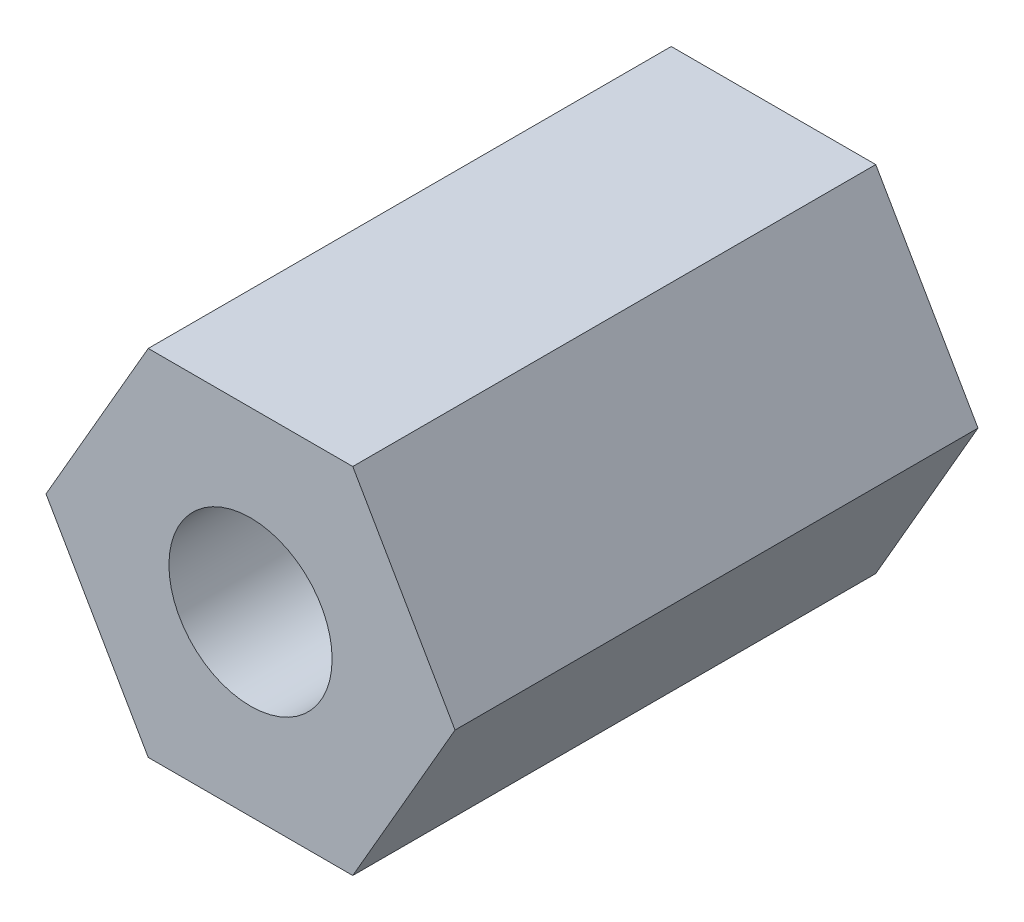
ISO-10303-21;
HEADER;
FILE_DESCRIPTION(('STEP AP214'),'2;1');
FILE_NAME('part.step','',(''),(''),'','','');
FILE_SCHEMA(('AUTOMOTIVE_DESIGN { 1 0 10303 214 1 1 1 1 }'));
ENDSEC;
DATA;
#1=APPLICATION_CONTEXT('core data for automotive mechanical design processes');
#2=APPLICATION_PROTOCOL_DEFINITION('international standard','automotive_design',2000,#1);
#3=PRODUCT_CONTEXT('',#1,'mechanical');
#4=PRODUCT('Part','Part','',(#3));
#5=PRODUCT_RELATED_PRODUCT_CATEGORY('part','',(#4));
#6=PRODUCT_DEFINITION_FORMATION('','',#4);
#7=PRODUCT_DEFINITION_CONTEXT('part definition',#1,'design');
#8=PRODUCT_DEFINITION('design','',#6,#7);
#9=PRODUCT_DEFINITION_SHAPE('','',#8);
#10=(LENGTH_UNIT() NAMED_UNIT(*) SI_UNIT(.MILLI.,.METRE.));
#11=(NAMED_UNIT(*) PLANE_ANGLE_UNIT() SI_UNIT($,.RADIAN.));
#12=(NAMED_UNIT(*) SI_UNIT($,.STERADIAN.) SOLID_ANGLE_UNIT());
#13=UNCERTAINTY_MEASURE_WITH_UNIT(LENGTH_MEASURE(1.E-05),#10,'distance_accuracy_value','');
#14=(GEOMETRIC_REPRESENTATION_CONTEXT(3) GLOBAL_UNCERTAINTY_ASSIGNED_CONTEXT((#13)) GLOBAL_UNIT_ASSIGNED_CONTEXT((#10,
#11,#12)) REPRESENTATION_CONTEXT('',''));
#15=CARTESIAN_POINT('',(0.,0.,0.));
#16=DIRECTION('',(0.,0.,1.));
#17=DIRECTION('',(1.,0.,0.));
#18=AXIS2_PLACEMENT_3D('',#15,#16,#17);
#19=CARTESIAN_POINT('',(-2.569208697894,0.,0.));
#20=DIRECTION('',(-0.866025403784429,-0.500000000000017,0.));
#21=DIRECTION('',(0.500000000000017,-0.866025403784429,0.));
#22=AXIS2_PLACEMENT_3D('',#19,#20,#21);
#23=PLANE('',#22);
#24=DIRECTION('',(0.,0.,1.));
#25=VECTOR('',#24,1.);
#26=CARTESIAN_POINT('',(-2.56920869789398,0.,0.));
#27=LINE('',#26,#25);
#28=CARTESIAN_POINT('',(-2.569208697894,0.,0.));
#29=VERTEX_POINT('',#28);
#30=CARTESIAN_POINT('',(-2.56920869789399,0.,6.57));
#31=VERTEX_POINT('',#30);
#32=EDGE_CURVE('E100',#29,#31,#27,.T.);
#33=ORIENTED_EDGE('',*,*,#32,.F.);
#34=DIRECTION('',(0.500000000000024,-0.866025403784425,0.));
#35=VECTOR('',#34,1.);
#36=CARTESIAN_POINT('',(-2.569208697894,0.,0.));
#37=LINE('',#36,#35);
#38=CARTESIAN_POINT('',(-1.28460434894701,-2.22500000000001,0.));
#39=VERTEX_POINT('',#38);
#40=EDGE_CURVE('E108',#29,#39,#37,.T.);
#41=ORIENTED_EDGE('',*,*,#40,.T.);
#42=DIRECTION('',(0.,0.,-1.));
#43=VECTOR('',#42,1.);
#44=CARTESIAN_POINT('',(-1.284604348947,-2.225,0.));
#45=LINE('',#44,#43);
#46=CARTESIAN_POINT('',(-1.284604348947,-2.225,6.57));
#47=VERTEX_POINT('',#46);
#48=EDGE_CURVE('E66',#47,#39,#45,.T.);
#49=ORIENTED_EDGE('',*,*,#48,.F.);
#50=DIRECTION('',(0.500000000000024,-0.866025403784425,0.));
#51=VECTOR('',#50,1.);
#52=CARTESIAN_POINT('',(-2.569208697894,0.,6.57));
#53=LINE('',#52,#51);
#54=EDGE_CURVE('E78',#31,#47,#53,.T.);
#55=ORIENTED_EDGE('',*,*,#54,.F.);
#56=EDGE_LOOP('',(#33,#41,#49,#55));
#57=FACE_BOUND('',#56,.T.);
#58=ADVANCED_FACE('F17',(#57),#23,.T.);
#59=CARTESIAN_POINT('',(-1.284604348947,-2.225,0.));
#60=DIRECTION('',(0.,-1.,0.));
#61=DIRECTION('',(0.,0.,-1.));
#62=AXIS2_PLACEMENT_3D('',#59,#60,#61);
#63=PLANE('',#62);
#64=ORIENTED_EDGE('',*,*,#48,.T.);
#65=DIRECTION('',(1.,0.,0.));
#66=VECTOR('',#65,1.);
#67=CARTESIAN_POINT('',(0.,-2.225,0.));
#68=LINE('',#67,#66);
#69=CARTESIAN_POINT('',(1.284604348947,-2.225,0.));
#70=VERTEX_POINT('',#69);
#71=EDGE_CURVE('E85',#39,#70,#68,.T.);
#72=ORIENTED_EDGE('',*,*,#71,.T.);
#73=DIRECTION('',(0.,0.,1.));
#74=VECTOR('',#73,1.);
#75=CARTESIAN_POINT('',(1.284604348947,-2.225,0.));
#76=LINE('',#75,#74);
#77=CARTESIAN_POINT('',(1.284604348947,-2.225,6.57));
#78=VERTEX_POINT('',#77);
#79=EDGE_CURVE('E82',#78,#70,#76,.F.);
#80=ORIENTED_EDGE('',*,*,#79,.F.);
#81=DIRECTION('',(1.,0.,0.));
#82=VECTOR('',#81,1.);
#83=CARTESIAN_POINT('',(0.,-2.225,6.57));
#84=LINE('',#83,#82);
#85=EDGE_CURVE('E71',#47,#78,#84,.T.);
#86=ORIENTED_EDGE('',*,*,#85,.F.);
#87=EDGE_LOOP('',(#64,#72,#80,#86));
#88=FACE_BOUND('',#87,.T.);
#89=ADVANCED_FACE('F83',(#88),#63,.T.);
#90=CARTESIAN_POINT('',(1.284604348947,-2.225,0.));
#91=DIRECTION('',(0.866025403784429,-0.500000000000017,0.));
#92=DIRECTION('',(0.500000000000017,0.866025403784429,0.));
#93=AXIS2_PLACEMENT_3D('',#90,#91,#92);
#94=PLANE('',#93);
#95=ORIENTED_EDGE('',*,*,#79,.T.);
#96=DIRECTION('',(0.500000000000024,0.866025403784425,0.));
#97=VECTOR('',#96,1.);
#98=CARTESIAN_POINT('',(1.284604348947,-2.225,0.));
#99=LINE('',#98,#97);
#100=CARTESIAN_POINT('',(2.56920869789399,0.,0.));
#101=VERTEX_POINT('',#100);
#102=EDGE_CURVE('E111',#70,#101,#99,.T.);
#103=ORIENTED_EDGE('',*,*,#102,.T.);
#104=DIRECTION('',(0.,0.,1.));
#105=VECTOR('',#104,1.);
#106=CARTESIAN_POINT('',(2.569208697894,0.,0.));
#107=LINE('',#106,#105);
#108=CARTESIAN_POINT('',(2.56920869789399,0.,6.57));
#109=VERTEX_POINT('',#108);
#110=EDGE_CURVE('E89',#109,#101,#107,.F.);
#111=ORIENTED_EDGE('',*,*,#110,.F.);
#112=DIRECTION('',(0.500000000000024,0.866025403784425,0.));
#113=VECTOR('',#112,1.);
#114=CARTESIAN_POINT('',(1.284604348947,-2.225,6.57));
#115=LINE('',#114,#113);
#116=EDGE_CURVE('E76',#78,#109,#115,.T.);
#117=ORIENTED_EDGE('',*,*,#116,.F.);
#118=EDGE_LOOP('',(#95,#103,#111,#117));
#119=FACE_BOUND('',#118,.T.);
#120=ADVANCED_FACE('F91',(#119),#94,.T.);
#121=CARTESIAN_POINT('',(2.569208697894,0.,0.));
#122=DIRECTION('',(0.866025403784429,0.500000000000017,0.));
#123=DIRECTION('',(-0.500000000000017,0.866025403784429,0.));
#124=AXIS2_PLACEMENT_3D('',#121,#122,#123);
#125=PLANE('',#124);
#126=ORIENTED_EDGE('',*,*,#110,.T.);
#127=DIRECTION('',(-0.500000000000024,0.866025403784425,0.));
#128=VECTOR('',#127,1.);
#129=CARTESIAN_POINT('',(2.569208697894,0.,0.));
#130=LINE('',#129,#128);
#131=CARTESIAN_POINT('',(1.28460434894701,2.22500000000001,0.));
#132=VERTEX_POINT('',#131);
#133=EDGE_CURVE('E128',#101,#132,#130,.T.);
#134=ORIENTED_EDGE('',*,*,#133,.T.);
#135=DIRECTION('',(0.,0.,1.));
#136=VECTOR('',#135,1.);
#137=CARTESIAN_POINT('',(1.284604348947,2.225,0.));
#138=LINE('',#137,#136);
#139=CARTESIAN_POINT('',(1.28460434894701,2.22500000000001,6.57));
#140=VERTEX_POINT('',#139);
#141=EDGE_CURVE('E102',#140,#132,#138,.F.);
#142=ORIENTED_EDGE('',*,*,#141,.F.);
#143=DIRECTION('',(-0.500000000000024,0.866025403784425,0.));
#144=VECTOR('',#143,1.);
#145=CARTESIAN_POINT('',(2.569208697894,0.,6.57));
#146=LINE('',#145,#144);
#147=EDGE_CURVE('E93',#109,#140,#146,.T.);
#148=ORIENTED_EDGE('',*,*,#147,.F.);
#149=EDGE_LOOP('',(#126,#134,#142,#148));
#150=FACE_BOUND('',#149,.T.);
#151=ADVANCED_FACE('F133',(#150),#125,.T.);
#152=CARTESIAN_POINT('',(1.284604348947,2.225,0.));
#153=DIRECTION('',(0.,1.,0.));
#154=DIRECTION('',(0.,0.,1.));
#155=AXIS2_PLACEMENT_3D('',#152,#153,#154);
#156=PLANE('',#155);
#157=ORIENTED_EDGE('',*,*,#141,.T.);
#158=DIRECTION('',(1.,0.,0.));
#159=VECTOR('',#158,1.);
#160=CARTESIAN_POINT('',(0.,2.225,0.));
#161=LINE('',#160,#159);
#162=CARTESIAN_POINT('',(-1.284604348947,2.225,0.));
#163=VERTEX_POINT('',#162);
#164=EDGE_CURVE('E123',#132,#163,#161,.F.);
#165=ORIENTED_EDGE('',*,*,#164,.T.);
#166=DIRECTION('',(0.,0.,1.));
#167=VECTOR('',#166,1.);
#168=CARTESIAN_POINT('',(-1.284604348947,2.225,0.));
#169=LINE('',#168,#167);
#170=CARTESIAN_POINT('',(-1.284604348947,2.225,6.57));
#171=VERTEX_POINT('',#170);
#172=EDGE_CURVE('E33',#171,#163,#169,.F.);
#173=ORIENTED_EDGE('',*,*,#172,.F.);
#174=DIRECTION('',(1.,0.,0.));
#175=VECTOR('',#174,1.);
#176=CARTESIAN_POINT('',(0.,2.225,6.57));
#177=LINE('',#176,#175);
#178=EDGE_CURVE('E95',#140,#171,#177,.F.);
#179=ORIENTED_EDGE('',*,*,#178,.F.);
#180=EDGE_LOOP('',(#157,#165,#173,#179));
#181=FACE_BOUND('',#180,.T.);
#182=ADVANCED_FACE('F122',(#181),#156,.T.);
#183=CARTESIAN_POINT('',(-1.284604348947,2.225,0.));
#184=DIRECTION('',(-0.866025403784429,0.500000000000017,0.));
#185=DIRECTION('',(-0.500000000000017,-0.866025403784429,0.));
#186=AXIS2_PLACEMENT_3D('',#183,#184,#185);
#187=PLANE('',#186);
#188=ORIENTED_EDGE('',*,*,#172,.T.);
#189=DIRECTION('',(-0.500000000000024,-0.866025403784425,0.));
#190=VECTOR('',#189,1.);
#191=CARTESIAN_POINT('',(-1.284604348947,2.225,0.));
#192=LINE('',#191,#190);
#193=EDGE_CURVE('E125',#163,#29,#192,.T.);
#194=ORIENTED_EDGE('',*,*,#193,.T.);
#195=ORIENTED_EDGE('',*,*,#32,.T.);
#196=DIRECTION('',(-0.500000000000024,-0.866025403784425,0.));
#197=VECTOR('',#196,1.);
#198=CARTESIAN_POINT('',(-1.284604348947,2.225,6.57));
#199=LINE('',#198,#197);
#200=EDGE_CURVE('E114',#171,#31,#199,.T.);
#201=ORIENTED_EDGE('',*,*,#200,.F.);
#202=EDGE_LOOP('',(#188,#194,#195,#201));
#203=FACE_BOUND('',#202,.T.);
#204=ADVANCED_FACE('F124',(#203),#187,.T.);
#205=CARTESIAN_POINT('',(0.,0.,6.57));
#206=DIRECTION('',(0.,0.,1.));
#207=DIRECTION('',(1.,0.,0.));
#208=AXIS2_PLACEMENT_3D('',#205,#206,#207);
#209=PLANE('',#208);
#210=CARTESIAN_POINT('',(0.,0.,6.57));
#211=DIRECTION('',(0.,0.,1.));
#212=DIRECTION('',(1.,0.,0.));
#213=AXIS2_PLACEMENT_3D('',#210,#211,#212);
#214=CIRCLE('',#213,1.025);
#215=CARTESIAN_POINT('',(1.025,0.,6.57));
#216=VERTEX_POINT('',#215);
#217=EDGE_CURVE('E20',#216,#216,#214,.F.);
#218=ORIENTED_EDGE('',*,*,#217,.T.);
#219=EDGE_LOOP('',(#218));
#220=FACE_BOUND('',#219,.T.);
#221=ORIENTED_EDGE('',*,*,#200,.T.);
#222=ORIENTED_EDGE('',*,*,#54,.T.);
#223=ORIENTED_EDGE('',*,*,#85,.T.);
#224=ORIENTED_EDGE('',*,*,#116,.T.);
#225=ORIENTED_EDGE('',*,*,#147,.T.);
#226=ORIENTED_EDGE('',*,*,#178,.T.);
#227=EDGE_LOOP('',(#221,#222,#223,#224,#225,#226));
#228=FACE_BOUND('',#227,.T.);
#229=ADVANCED_FACE('F74',(#220,#228),#209,.T.);
#230=CARTESIAN_POINT('',(0.,0.,0.));
#231=DIRECTION('',(0.,0.,1.));
#232=DIRECTION('',(1.,0.,0.));
#233=AXIS2_PLACEMENT_3D('',#230,#231,#232);
#234=PLANE('',#233);
#235=CARTESIAN_POINT('',(0.,0.,0.));
#236=DIRECTION('',(0.,0.,1.));
#237=DIRECTION('',(1.,0.,0.));
#238=AXIS2_PLACEMENT_3D('',#235,#236,#237);
#239=CIRCLE('',#238,1.025);
#240=CARTESIAN_POINT('',(1.025,0.,0.));
#241=VERTEX_POINT('',#240);
#242=EDGE_CURVE('E11',#241,#241,#239,.T.);
#243=ORIENTED_EDGE('',*,*,#242,.T.);
#244=EDGE_LOOP('',(#243));
#245=FACE_BOUND('',#244,.T.);
#246=ORIENTED_EDGE('',*,*,#164,.F.);
#247=ORIENTED_EDGE('',*,*,#133,.F.);
#248=ORIENTED_EDGE('',*,*,#102,.F.);
#249=ORIENTED_EDGE('',*,*,#71,.F.);
#250=ORIENTED_EDGE('',*,*,#40,.F.);
#251=ORIENTED_EDGE('',*,*,#193,.F.);
#252=EDGE_LOOP('',(#246,#247,#248,#249,#250,#251));
#253=FACE_BOUND('',#252,.T.);
#254=ADVANCED_FACE('F107',(#245,#253),#234,.F.);
#255=CARTESIAN_POINT('',(0.,0.,-1.01835));
#256=DIRECTION('',(0.,0.,1.));
#257=DIRECTION('',(1.,0.,0.));
#258=AXIS2_PLACEMENT_3D('',#255,#256,#257);
#259=CYLINDRICAL_SURFACE('',#258,1.025);
#260=ORIENTED_EDGE('',*,*,#242,.F.);
#261=EDGE_LOOP('',(#260));
#262=FACE_BOUND('',#261,.T.);
#263=ORIENTED_EDGE('',*,*,#217,.F.);
#264=EDGE_LOOP('',(#263));
#265=FACE_BOUND('',#264,.T.);
#266=ADVANCED_FACE('F143',(#262,#265),#259,.F.);
#267=CLOSED_SHELL('',(#58,#89,#120,#151,#182,#204,#229,#254,#266));
#268=MANIFOLD_SOLID_BREP('B1',#267);
#269=ADVANCED_BREP_SHAPE_REPRESENTATION('',(#18,#268),#14);
#270=SHAPE_DEFINITION_REPRESENTATION(#9,#269);
ENDSEC;
END-ISO-10303-21;
